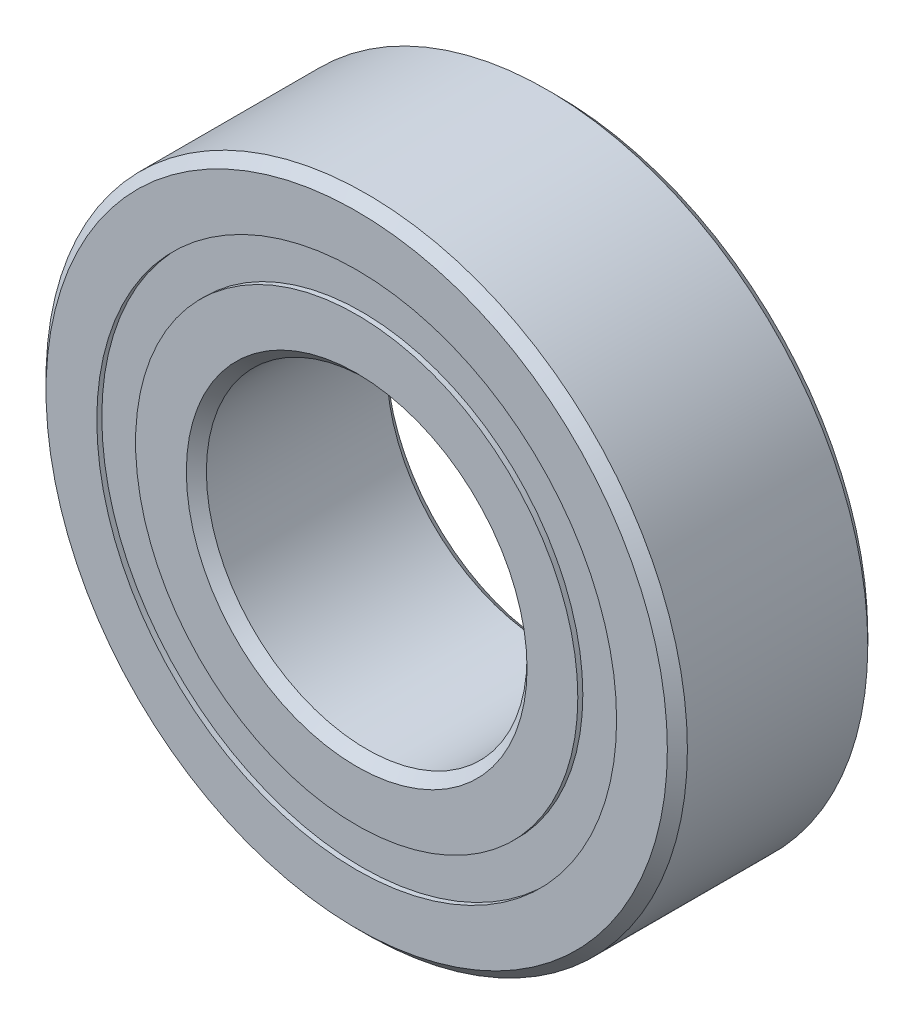
ISO-10303-21;
HEADER;
FILE_DESCRIPTION(('STEP AP214'),'2;1');
FILE_NAME('part.step','',(''),(''),'','','');
FILE_SCHEMA(('AUTOMOTIVE_DESIGN { 1 0 10303 214 1 1 1 1 }'));
ENDSEC;
DATA;
#1=APPLICATION_CONTEXT('core data for automotive mechanical design processes');
#2=APPLICATION_PROTOCOL_DEFINITION('international standard','automotive_design',2000,#1);
#3=PRODUCT_CONTEXT('',#1,'mechanical');
#4=PRODUCT('Part','Part','',(#3));
#5=PRODUCT_RELATED_PRODUCT_CATEGORY('part','',(#4));
#6=PRODUCT_DEFINITION_FORMATION('','',#4);
#7=PRODUCT_DEFINITION_CONTEXT('part definition',#1,'design');
#8=PRODUCT_DEFINITION('design','',#6,#7);
#9=PRODUCT_DEFINITION_SHAPE('','',#8);
#10=(LENGTH_UNIT() NAMED_UNIT(*) SI_UNIT(.MILLI.,.METRE.));
#11=(NAMED_UNIT(*) PLANE_ANGLE_UNIT() SI_UNIT($,.RADIAN.));
#12=(NAMED_UNIT(*) SI_UNIT($,.STERADIAN.) SOLID_ANGLE_UNIT());
#13=UNCERTAINTY_MEASURE_WITH_UNIT(LENGTH_MEASURE(1.E-05),#10,'distance_accuracy_value','');
#14=(GEOMETRIC_REPRESENTATION_CONTEXT(3) GLOBAL_UNCERTAINTY_ASSIGNED_CONTEXT((#13)) GLOBAL_UNIT_ASSIGNED_CONTEXT((#10,
#11,#12)) REPRESENTATION_CONTEXT('',''));
#15=CARTESIAN_POINT('',(0.,0.,0.));
#16=DIRECTION('',(0.,0.,1.));
#17=DIRECTION('',(1.,0.,0.));
#18=AXIS2_PLACEMENT_3D('',#15,#16,#17);
#19=CARTESIAN_POINT('',(0.,6.48351648351648,-2.375));
#20=DIRECTION('',(0.,0.,1.));
#21=DIRECTION('',(1.,0.,0.));
#22=AXIS2_PLACEMENT_3D('',#19,#20,#21);
#23=PLANE('',#22);
#24=CARTESIAN_POINT('',(0.,0.,-2.375));
#25=DIRECTION('',(0.,0.,1.));
#26=DIRECTION('',(1.,0.,0.));
#27=AXIS2_PLACEMENT_3D('',#24,#25,#26);
#28=CIRCLE('',#27,6.48351648351648);
#29=CARTESIAN_POINT('',(6.48351648351648,0.,-2.375));
#30=VERTEX_POINT('',#29);
#31=EDGE_CURVE('E57',#30,#30,#28,.T.);
#32=ORIENTED_EDGE('',*,*,#31,.F.);
#33=EDGE_LOOP('',(#32));
#34=FACE_BOUND('',#33,.T.);
#35=CARTESIAN_POINT('',(0.,0.,-2.375));
#36=DIRECTION('',(0.,0.,1.));
#37=DIRECTION('',(1.,0.,0.));
#38=AXIS2_PLACEMENT_3D('',#35,#36,#37);
#39=CIRCLE('',#38,5.51648351648352);
#40=CARTESIAN_POINT('',(5.51648351648352,0.,-2.375));
#41=VERTEX_POINT('',#40);
#42=EDGE_CURVE('E11',#41,#41,#39,.T.);
#43=ORIENTED_EDGE('',*,*,#42,.T.);
#44=EDGE_LOOP('',(#43));
#45=FACE_BOUND('',#44,.T.);
#46=ADVANCED_FACE('F43',(#34,#45),#23,.F.);
#47=CARTESIAN_POINT('',(0.,0.,2.5));
#48=DIRECTION('',(0.,0.,1.));
#49=DIRECTION('',(1.,0.,0.));
#50=AXIS2_PLACEMENT_3D('',#47,#48,#49);
#51=CYLINDRICAL_SURFACE('',#50,5.51648351648352);
#52=ORIENTED_EDGE('',*,*,#42,.F.);
#53=EDGE_LOOP('',(#52));
#54=FACE_BOUND('',#53,.T.);
#55=CARTESIAN_POINT('',(0.,0.,-1.21175743903915));
#56=DIRECTION('',(0.,0.,1.));
#57=DIRECTION('',(1.,0.,0.));
#58=AXIS2_PLACEMENT_3D('',#55,#56,#57);
#59=CIRCLE('',#58,5.51648351648352);
#60=CARTESIAN_POINT('',(5.51648351648352,0.,-1.21175743903915));
#61=VERTEX_POINT('',#60);
#62=EDGE_CURVE('E49',#61,#61,#59,.T.);
#63=ORIENTED_EDGE('',*,*,#62,.T.);
#64=EDGE_LOOP('',(#63));
#65=FACE_BOUND('',#64,.T.);
#66=ADVANCED_FACE('F66',(#54,#65),#51,.F.);
#67=CARTESIAN_POINT('',(0.,6.48351648351648,-1.21175743903915));
#68=DIRECTION('',(0.,0.,-1.));
#69=DIRECTION('',(-1.,0.,0.));
#70=AXIS2_PLACEMENT_3D('',#67,#68,#69);
#71=PLANE('',#70);
#72=ORIENTED_EDGE('',*,*,#62,.F.);
#73=EDGE_LOOP('',(#72));
#74=FACE_BOUND('',#73,.T.);
#75=CARTESIAN_POINT('',(0.,0.,-1.21175743903915));
#76=DIRECTION('',(0.,0.,1.));
#77=DIRECTION('',(1.,0.,0.));
#78=AXIS2_PLACEMENT_3D('',#75,#76,#77);
#79=CIRCLE('',#78,6.48351648351648);
#80=CARTESIAN_POINT('',(6.48351648351648,0.,-1.21175743903915));
#81=VERTEX_POINT('',#80);
#82=EDGE_CURVE('E53',#81,#81,#79,.T.);
#83=ORIENTED_EDGE('',*,*,#82,.T.);
#84=EDGE_LOOP('',(#83));
#85=FACE_BOUND('',#84,.T.);
#86=ADVANCED_FACE('F70',(#74,#85),#71,.F.);
#87=CARTESIAN_POINT('',(0.,0.,2.5));
#88=DIRECTION('',(0.,0.,1.));
#89=DIRECTION('',(1.,0.,0.));
#90=AXIS2_PLACEMENT_3D('',#87,#88,#89);
#91=CYLINDRICAL_SURFACE('',#90,6.48351648351648);
#92=ORIENTED_EDGE('',*,*,#82,.F.);
#93=EDGE_LOOP('',(#92));
#94=FACE_BOUND('',#93,.T.);
#95=ORIENTED_EDGE('',*,*,#31,.T.);
#96=EDGE_LOOP('',(#95));
#97=FACE_BOUND('',#96,.T.);
#98=ADVANCED_FACE('F63',(#94,#97),#91,.T.);
#99=CLOSED_SHELL('',(#46,#66,#86,#98));
#100=MANIFOLD_SOLID_BREP('B2',#99);
#101=CARTESIAN_POINT('',(0.,6.48351648351648,2.375));
#102=DIRECTION('',(0.,0.,-1.));
#103=DIRECTION('',(-1.,0.,0.));
#104=AXIS2_PLACEMENT_3D('',#101,#102,#103);
#105=PLANE('',#104);
#106=CARTESIAN_POINT('',(0.,0.,2.375));
#107=DIRECTION('',(0.,0.,1.));
#108=DIRECTION('',(1.,0.,0.));
#109=AXIS2_PLACEMENT_3D('',#106,#107,#108);
#110=CIRCLE('',#109,5.51648351648352);
#111=CARTESIAN_POINT('',(5.51648351648352,0.,2.375));
#112=VERTEX_POINT('',#111);
#113=EDGE_CURVE('E42',#112,#112,#110,.T.);
#114=ORIENTED_EDGE('',*,*,#113,.F.);
#115=EDGE_LOOP('',(#114));
#116=FACE_BOUND('',#115,.T.);
#117=CARTESIAN_POINT('',(0.,0.,2.375));
#118=DIRECTION('',(0.,0.,1.));
#119=DIRECTION('',(1.,0.,0.));
#120=AXIS2_PLACEMENT_3D('',#117,#118,#119);
#121=CIRCLE('',#120,6.48351648351648);
#122=CARTESIAN_POINT('',(6.48351648351648,0.,2.375));
#123=VERTEX_POINT('',#122);
#124=EDGE_CURVE('E124',#123,#123,#121,.T.);
#125=ORIENTED_EDGE('',*,*,#124,.T.);
#126=EDGE_LOOP('',(#125));
#127=FACE_BOUND('',#126,.T.);
#128=ADVANCED_FACE('F110',(#116,#127),#105,.F.);
#129=CARTESIAN_POINT('',(0.,0.,2.5));
#130=DIRECTION('',(0.,0.,1.));
#131=DIRECTION('',(1.,0.,0.));
#132=AXIS2_PLACEMENT_3D('',#129,#130,#131);
#133=CYLINDRICAL_SURFACE('',#132,5.51648351648352);
#134=CARTESIAN_POINT('',(0.,0.,1.21175743903915));
#135=DIRECTION('',(0.,0.,1.));
#136=DIRECTION('',(1.,0.,0.));
#137=AXIS2_PLACEMENT_3D('',#134,#135,#136);
#138=CIRCLE('',#137,5.51648351648352);
#139=CARTESIAN_POINT('',(5.51648351648352,0.,1.21175743903915));
#140=VERTEX_POINT('',#139);
#141=EDGE_CURVE('E116',#140,#140,#138,.T.);
#142=ORIENTED_EDGE('',*,*,#141,.F.);
#143=EDGE_LOOP('',(#142));
#144=FACE_BOUND('',#143,.T.);
#145=ORIENTED_EDGE('',*,*,#113,.T.);
#146=EDGE_LOOP('',(#145));
#147=FACE_BOUND('',#146,.T.);
#148=ADVANCED_FACE('F139',(#144,#147),#133,.F.);
#149=CARTESIAN_POINT('',(0.,6.48351648351648,1.21175743903915));
#150=DIRECTION('',(0.,0.,1.));
#151=DIRECTION('',(1.,0.,0.));
#152=AXIS2_PLACEMENT_3D('',#149,#150,#151);
#153=PLANE('',#152);
#154=CARTESIAN_POINT('',(0.,0.,1.21175743903915));
#155=DIRECTION('',(0.,0.,1.));
#156=DIRECTION('',(1.,0.,0.));
#157=AXIS2_PLACEMENT_3D('',#154,#155,#156);
#158=CIRCLE('',#157,6.48351648351648);
#159=CARTESIAN_POINT('',(6.48351648351648,0.,1.21175743903915));
#160=VERTEX_POINT('',#159);
#161=EDGE_CURVE('E120',#160,#160,#158,.T.);
#162=ORIENTED_EDGE('',*,*,#161,.F.);
#163=EDGE_LOOP('',(#162));
#164=FACE_BOUND('',#163,.T.);
#165=ORIENTED_EDGE('',*,*,#141,.T.);
#166=EDGE_LOOP('',(#165));
#167=FACE_BOUND('',#166,.T.);
#168=ADVANCED_FACE('F134',(#164,#167),#153,.F.);
#169=CARTESIAN_POINT('',(0.,0.,2.5));
#170=DIRECTION('',(0.,0.,1.));
#171=DIRECTION('',(1.,0.,0.));
#172=AXIS2_PLACEMENT_3D('',#169,#170,#171);
#173=CYLINDRICAL_SURFACE('',#172,6.48351648351648);
#174=ORIENTED_EDGE('',*,*,#124,.F.);
#175=EDGE_LOOP('',(#174));
#176=FACE_BOUND('',#175,.T.);
#177=ORIENTED_EDGE('',*,*,#161,.T.);
#178=EDGE_LOOP('',(#177));
#179=FACE_BOUND('',#178,.T.);
#180=ADVANCED_FACE('F131',(#176,#179),#173,.T.);
#181=CLOSED_SHELL('',(#128,#148,#168,#180));
#182=MANIFOLD_SOLID_BREP('B6',#181);
#183=CARTESIAN_POINT('',(-2.99999999999993,5.19615242270667,0.));
#184=DIRECTION('',(0.,0.,1.));
#185=DIRECTION('',(-0.499999999999989,0.866025403784445,0.));
#186=AXIS2_PLACEMENT_3D('',#183,#184,#185);
#187=SPHERICAL_SURFACE('',#186,1.21175743903915);
#188=CARTESIAN_POINT('',(-2.99999999999993,5.19615242270667,1.21175743903915));
#189=VERTEX_POINT('',#188);
#190=VERTEX_LOOP('',#189);
#191=FACE_BOUND('',#190,.T.);
#192=ADVANCED_FACE('F177',(#191),#187,.T.);
#193=CLOSED_SHELL('',(#192));
#194=MANIFOLD_SOLID_BREP('B37',#193);
#195=CARTESIAN_POINT('',(-5.1961524227066,3.00000000000006,0.));
#196=DIRECTION('',(0.,0.,1.));
#197=DIRECTION('',(-0.866025403784433,0.50000000000001,0.));
#198=AXIS2_PLACEMENT_3D('',#195,#196,#197);
#199=SPHERICAL_SURFACE('',#198,1.21175743903915);
#200=CARTESIAN_POINT('',(-5.1961524227066,3.00000000000006,1.21175743903915));
#201=VERTEX_POINT('',#200);
#202=VERTEX_LOOP('',#201);
#203=FACE_BOUND('',#202,.T.);
#204=ADVANCED_FACE('F197',(#203),#199,.T.);
#205=CLOSED_SHELL('',(#204));
#206=MANIFOLD_SOLID_BREP('B106',#205);
#207=CARTESIAN_POINT('',(-6.,0.,0.));
#208=DIRECTION('',(0.,0.,1.));
#209=DIRECTION('',(-1.,0.,0.));
#210=AXIS2_PLACEMENT_3D('',#207,#208,#209);
#211=SPHERICAL_SURFACE('',#210,1.21175743903915);
#212=CARTESIAN_POINT('',(-6.,0.,1.21175743903915));
#213=VERTEX_POINT('',#212);
#214=VERTEX_LOOP('',#213);
#215=FACE_BOUND('',#214,.T.);
#216=ADVANCED_FACE('F217',(#215),#211,.T.);
#217=CLOSED_SHELL('',(#216));
#218=MANIFOLD_SOLID_BREP('B173',#217);
#219=CARTESIAN_POINT('',(-5.19615242270666,-2.99999999999995,0.));
#220=DIRECTION('',(0.,0.,1.));
#221=DIRECTION('',(-0.866025403784443,-0.499999999999992,0.));
#222=AXIS2_PLACEMENT_3D('',#219,#220,#221);
#223=SPHERICAL_SURFACE('',#222,1.21175743903915);
#224=CARTESIAN_POINT('',(-5.19615242270666,-2.99999999999995,1.21175743903915));
#225=VERTEX_POINT('',#224);
#226=VERTEX_LOOP('',#225);
#227=FACE_BOUND('',#226,.T.);
#228=ADVANCED_FACE('F237',(#227),#223,.T.);
#229=CLOSED_SHELL('',(#228));
#230=MANIFOLD_SOLID_BREP('B193',#229);
#231=CARTESIAN_POINT('',(-3.00000000000004,-5.19615242270661,0.));
#232=DIRECTION('',(0.,0.,1.));
#233=DIRECTION('',(-0.500000000000007,-0.866025403784435,0.));
#234=AXIS2_PLACEMENT_3D('',#231,#232,#233);
#235=SPHERICAL_SURFACE('',#234,1.21175743903915);
#236=CARTESIAN_POINT('',(-3.00000000000004,-5.19615242270661,1.21175743903915));
#237=VERTEX_POINT('',#236);
#238=VERTEX_LOOP('',#237);
#239=FACE_BOUND('',#238,.T.);
#240=ADVANCED_FACE('F257',(#239),#235,.T.);
#241=CLOSED_SHELL('',(#240));
#242=MANIFOLD_SOLID_BREP('B213',#241);
#243=CARTESIAN_POINT('',(0.,-6.,0.));
#244=DIRECTION('',(0.,0.,1.));
#245=DIRECTION('',(0.,-1.,0.));
#246=AXIS2_PLACEMENT_3D('',#243,#244,#245);
#247=SPHERICAL_SURFACE('',#246,1.21175743903915);
#248=CARTESIAN_POINT('',(0.,-6.,1.21175743903915));
#249=VERTEX_POINT('',#248);
#250=VERTEX_LOOP('',#249);
#251=FACE_BOUND('',#250,.T.);
#252=ADVANCED_FACE('F277',(#251),#247,.T.);
#253=CLOSED_SHELL('',(#252));
#254=MANIFOLD_SOLID_BREP('B233',#253);
#255=CARTESIAN_POINT('',(2.99999999999997,-5.19615242270665,0.));
#256=DIRECTION('',(0.,0.,1.));
#257=DIRECTION('',(0.499999999999995,-0.866025403784442,0.));
#258=AXIS2_PLACEMENT_3D('',#255,#256,#257);
#259=SPHERICAL_SURFACE('',#258,1.21175743903915);
#260=CARTESIAN_POINT('',(2.99999999999997,-5.19615242270665,1.21175743903915));
#261=VERTEX_POINT('',#260);
#262=VERTEX_LOOP('',#261);
#263=FACE_BOUND('',#262,.T.);
#264=ADVANCED_FACE('F297',(#263),#259,.T.);
#265=CLOSED_SHELL('',(#264));
#266=MANIFOLD_SOLID_BREP('B253',#265);
#267=CARTESIAN_POINT('',(5.19615242270662,-3.00000000000002,0.));
#268=DIRECTION('',(0.,0.,1.));
#269=DIRECTION('',(0.866025403784436,-0.500000000000004,0.));
#270=AXIS2_PLACEMENT_3D('',#267,#268,#269);
#271=SPHERICAL_SURFACE('',#270,1.21175743903915);
#272=CARTESIAN_POINT('',(5.19615242270662,-3.00000000000002,1.21175743903915));
#273=VERTEX_POINT('',#272);
#274=VERTEX_LOOP('',#273);
#275=FACE_BOUND('',#274,.T.);
#276=ADVANCED_FACE('F317',(#275),#271,.T.);
#277=CLOSED_SHELL('',(#276));
#278=MANIFOLD_SOLID_BREP('B273',#277);
#279=CARTESIAN_POINT('',(6.,0.,0.));
#280=DIRECTION('',(0.,0.,1.));
#281=DIRECTION('',(1.,0.,0.));
#282=AXIS2_PLACEMENT_3D('',#279,#280,#281);
#283=SPHERICAL_SURFACE('',#282,1.21175743903915);
#284=CARTESIAN_POINT('',(6.,0.,1.21175743903915));
#285=VERTEX_POINT('',#284);
#286=VERTEX_LOOP('',#285);
#287=FACE_BOUND('',#286,.T.);
#288=ADVANCED_FACE('F337',(#287),#283,.T.);
#289=CLOSED_SHELL('',(#288));
#290=MANIFOLD_SOLID_BREP('B293',#289);
#291=CARTESIAN_POINT('',(5.19615242270664,2.99999999999999,0.));
#292=DIRECTION('',(0.,0.,1.));
#293=DIRECTION('',(0.86602540378444,0.499999999999998,0.));
#294=AXIS2_PLACEMENT_3D('',#291,#292,#293);
#295=SPHERICAL_SURFACE('',#294,1.21175743903915);
#296=CARTESIAN_POINT('',(5.19615242270664,2.99999999999999,1.21175743903915));
#297=VERTEX_POINT('',#296);
#298=VERTEX_LOOP('',#297);
#299=FACE_BOUND('',#298,.T.);
#300=ADVANCED_FACE('F357',(#299),#295,.T.);
#301=CLOSED_SHELL('',(#300));
#302=MANIFOLD_SOLID_BREP('B313',#301);
#303=CARTESIAN_POINT('',(3.00000000000001,5.19615242270663,0.));
#304=DIRECTION('',(0.,0.,1.));
#305=DIRECTION('',(0.500000000000001,0.866025403784438,0.));
#306=AXIS2_PLACEMENT_3D('',#303,#304,#305);
#307=SPHERICAL_SURFACE('',#306,1.21175743903915);
#308=CARTESIAN_POINT('',(3.00000000000001,5.19615242270663,1.21175743903915));
#309=VERTEX_POINT('',#308);
#310=VERTEX_LOOP('',#309);
#311=FACE_BOUND('',#310,.T.);
#312=ADVANCED_FACE('F377',(#311),#307,.T.);
#313=CLOSED_SHELL('',(#312));
#314=MANIFOLD_SOLID_BREP('B333',#313);
#315=CARTESIAN_POINT('',(0.,6.,0.));
#316=DIRECTION('',(0.,0.,1.));
#317=DIRECTION('',(0.,1.,0.));
#318=AXIS2_PLACEMENT_3D('',#315,#316,#317);
#319=SPHERICAL_SURFACE('',#318,1.21175743903915);
#320=CARTESIAN_POINT('',(0.,6.,1.21175743903915));
#321=VERTEX_POINT('',#320);
#322=VERTEX_LOOP('',#321);
#323=FACE_BOUND('',#322,.T.);
#324=ADVANCED_FACE('F399',(#323),#319,.T.);
#325=CLOSED_SHELL('',(#324));
#326=MANIFOLD_SOLID_BREP('B353',#325);
#327=CARTESIAN_POINT('',(0.,5.51648351648352,2.5));
#328=DIRECTION('',(0.,0.,-1.));
#329=DIRECTION('',(-1.,0.,0.));
#330=AXIS2_PLACEMENT_3D('',#327,#328,#329);
#331=PLANE('',#330);
#332=CARTESIAN_POINT('',(0.,0.,2.5));
#333=DIRECTION('',(0.,0.,1.));
#334=DIRECTION('',(1.,0.,0.));
#335=AXIS2_PLACEMENT_3D('',#332,#333,#334);
#336=CIRCLE('',#335,4.25);
#337=CARTESIAN_POINT('',(4.25,0.,2.5));
#338=VERTEX_POINT('',#337);
#339=EDGE_CURVE('E446',#338,#338,#336,.T.);
#340=ORIENTED_EDGE('',*,*,#339,.F.);
#341=EDGE_LOOP('',(#340));
#342=FACE_BOUND('',#341,.T.);
#343=CARTESIAN_POINT('',(0.,0.,2.5));
#344=DIRECTION('',(0.,0.,1.));
#345=DIRECTION('',(1.,0.,0.));
#346=AXIS2_PLACEMENT_3D('',#343,#344,#345);
#347=CIRCLE('',#346,5.51648351648352);
#348=CARTESIAN_POINT('',(5.51648351648352,0.,2.5));
#349=VERTEX_POINT('',#348);
#350=EDGE_CURVE('E398',#349,#349,#347,.T.);
#351=ORIENTED_EDGE('',*,*,#350,.T.);
#352=EDGE_LOOP('',(#351));
#353=FACE_BOUND('',#352,.T.);
#354=ADVANCED_FACE('F418',(#342,#353),#331,.F.);
#355=CARTESIAN_POINT('',(0.,0.,2.5));
#356=DIRECTION('',(0.,0.,1.));
#357=DIRECTION('',(1.,0.,0.));
#358=AXIS2_PLACEMENT_3D('',#355,#356,#357);
#359=CYLINDRICAL_SURFACE('',#358,5.51648351648352);
#360=ORIENTED_EDGE('',*,*,#350,.F.);
#361=EDGE_LOOP('',(#360));
#362=FACE_BOUND('',#361,.T.);
#363=CARTESIAN_POINT('',(0.,0.,1.11111111111111));
#364=DIRECTION('',(0.,0.,1.));
#365=DIRECTION('',(1.,0.,0.));
#366=AXIS2_PLACEMENT_3D('',#363,#364,#365);
#367=CIRCLE('',#366,5.51648351648352);
#368=CARTESIAN_POINT('',(5.51648351648352,0.,1.11111111111111));
#369=VERTEX_POINT('',#368);
#370=EDGE_CURVE('E424',#369,#369,#367,.T.);
#371=ORIENTED_EDGE('',*,*,#370,.T.);
#372=EDGE_LOOP('',(#371));
#373=FACE_BOUND('',#372,.T.);
#374=ADVANCED_FACE('F453',(#362,#373),#359,.T.);
#375=CARTESIAN_POINT('',(0.,0.,0.));
#376=DIRECTION('',(0.,0.,1.));
#377=DIRECTION('',(1.,0.,0.));
#378=AXIS2_PLACEMENT_3D('',#375,#376,#377);
#379=TOROIDAL_SURFACE('',#378,6.,1.21175743903915);
#380=ORIENTED_EDGE('',*,*,#370,.F.);
#381=EDGE_LOOP('',(#380));
#382=FACE_BOUND('',#381,.T.);
#383=CARTESIAN_POINT('',(0.,0.,-1.11111111111111));
#384=DIRECTION('',(0.,0.,1.));
#385=DIRECTION('',(1.,0.,0.));
#386=AXIS2_PLACEMENT_3D('',#383,#384,#385);
#387=CIRCLE('',#386,5.51648351648352);
#388=CARTESIAN_POINT('',(5.51648351648352,0.,-1.11111111111111));
#389=VERTEX_POINT('',#388);
#390=EDGE_CURVE('E428',#389,#389,#387,.T.);
#391=ORIENTED_EDGE('',*,*,#390,.T.);
#392=EDGE_LOOP('',(#391));
#393=FACE_BOUND('',#392,.T.);
#394=ADVANCED_FACE('F457',(#382,#393),#379,.F.);
#395=CARTESIAN_POINT('',(0.,0.,2.5));
#396=DIRECTION('',(0.,0.,1.));
#397=DIRECTION('',(1.,0.,0.));
#398=AXIS2_PLACEMENT_3D('',#395,#396,#397);
#399=CYLINDRICAL_SURFACE('',#398,5.51648351648352);
#400=ORIENTED_EDGE('',*,*,#390,.F.);
#401=EDGE_LOOP('',(#400));
#402=FACE_BOUND('',#401,.T.);
#403=CARTESIAN_POINT('',(0.,0.,-2.5));
#404=DIRECTION('',(0.,0.,1.));
#405=DIRECTION('',(1.,0.,0.));
#406=AXIS2_PLACEMENT_3D('',#403,#404,#405);
#407=CIRCLE('',#406,5.51648351648352);
#408=CARTESIAN_POINT('',(5.51648351648352,0.,-2.5));
#409=VERTEX_POINT('',#408);
#410=EDGE_CURVE('E432',#409,#409,#407,.T.);
#411=ORIENTED_EDGE('',*,*,#410,.T.);
#412=EDGE_LOOP('',(#411));
#413=FACE_BOUND('',#412,.T.);
#414=ADVANCED_FACE('F462',(#402,#413),#399,.T.);
#415=CARTESIAN_POINT('',(0.,4.25,-2.5));
#416=DIRECTION('',(0.,0.,1.));
#417=DIRECTION('',(1.,0.,0.));
#418=AXIS2_PLACEMENT_3D('',#415,#416,#417);
#419=PLANE('',#418);
#420=ORIENTED_EDGE('',*,*,#410,.F.);
#421=EDGE_LOOP('',(#420));
#422=FACE_BOUND('',#421,.T.);
#423=CARTESIAN_POINT('',(0.,0.,-2.5));
#424=DIRECTION('',(0.,0.,1.));
#425=DIRECTION('',(1.,0.,0.));
#426=AXIS2_PLACEMENT_3D('',#423,#424,#425);
#427=CIRCLE('',#426,4.25);
#428=CARTESIAN_POINT('',(4.25,0.,-2.5));
#429=VERTEX_POINT('',#428);
#430=EDGE_CURVE('E437',#429,#429,#427,.T.);
#431=ORIENTED_EDGE('',*,*,#430,.T.);
#432=EDGE_LOOP('',(#431));
#433=FACE_BOUND('',#432,.T.);
#434=ADVANCED_FACE('F468',(#422,#433),#419,.F.);
#435=CARTESIAN_POINT('',(0.,0.,-2.25));
#436=DIRECTION('',(0.,0.,-1.));
#437=DIRECTION('',(-1.,0.,0.));
#438=AXIS2_PLACEMENT_3D('',#435,#436,#437);
#439=CONICAL_SURFACE('',#438,4.,0.785398163397447);
#440=ORIENTED_EDGE('',*,*,#430,.F.);
#441=EDGE_LOOP('',(#440));
#442=FACE_BOUND('',#441,.T.);
#443=CARTESIAN_POINT('',(0.,0.,-2.25));
#444=DIRECTION('',(0.,0.,1.));
#445=DIRECTION('',(1.,0.,0.));
#446=AXIS2_PLACEMENT_3D('',#443,#444,#445);
#447=CIRCLE('',#446,4.);
#448=CARTESIAN_POINT('',(4.,0.,-2.25));
#449=VERTEX_POINT('',#448);
#450=EDGE_CURVE('E440',#449,#449,#447,.T.);
#451=ORIENTED_EDGE('',*,*,#450,.T.);
#452=EDGE_LOOP('',(#451));
#453=FACE_BOUND('',#452,.T.);
#454=ADVANCED_FACE('F472',(#442,#453),#439,.F.);
#455=CARTESIAN_POINT('',(0.,0.,2.5));
#456=DIRECTION('',(0.,0.,1.));
#457=DIRECTION('',(1.,0.,0.));
#458=AXIS2_PLACEMENT_3D('',#455,#456,#457);
#459=CYLINDRICAL_SURFACE('',#458,4.);
#460=ORIENTED_EDGE('',*,*,#450,.F.);
#461=EDGE_LOOP('',(#460));
#462=FACE_BOUND('',#461,.T.);
#463=CARTESIAN_POINT('',(0.,0.,2.25));
#464=DIRECTION('',(0.,0.,1.));
#465=DIRECTION('',(1.,0.,0.));
#466=AXIS2_PLACEMENT_3D('',#463,#464,#465);
#467=CIRCLE('',#466,4.);
#468=CARTESIAN_POINT('',(4.,0.,2.25));
#469=VERTEX_POINT('',#468);
#470=EDGE_CURVE('E443',#469,#469,#467,.T.);
#471=ORIENTED_EDGE('',*,*,#470,.T.);
#472=EDGE_LOOP('',(#471));
#473=FACE_BOUND('',#472,.T.);
#474=ADVANCED_FACE('F476',(#462,#473),#459,.F.);
#475=CARTESIAN_POINT('',(0.,0.,2.5));
#476=DIRECTION('',(0.,0.,1.));
#477=DIRECTION('',(1.,0.,0.));
#478=AXIS2_PLACEMENT_3D('',#475,#476,#477);
#479=CONICAL_SURFACE('',#478,4.25,0.785398163397452);
#480=ORIENTED_EDGE('',*,*,#470,.F.);
#481=EDGE_LOOP('',(#480));
#482=FACE_BOUND('',#481,.T.);
#483=ORIENTED_EDGE('',*,*,#339,.T.);
#484=EDGE_LOOP('',(#483));
#485=FACE_BOUND('',#484,.T.);
#486=ADVANCED_FACE('F450',(#482,#485),#479,.F.);
#487=CLOSED_SHELL('',(#354,#374,#394,#414,#434,#454,#474,#486));
#488=MANIFOLD_SOLID_BREP('B373',#487);
#489=CARTESIAN_POINT('',(0.,0.,2.25));
#490=DIRECTION('',(0.,0.,-1.));
#491=DIRECTION('',(-1.,0.,0.));
#492=AXIS2_PLACEMENT_3D('',#489,#490,#491);
#493=CONICAL_SURFACE('',#492,8.,0.785398163397448);
#494=CARTESIAN_POINT('',(0.,0.,2.5));
#495=DIRECTION('',(0.,0.,1.));
#496=DIRECTION('',(1.,0.,0.));
#497=AXIS2_PLACEMENT_3D('',#494,#495,#496);
#498=CIRCLE('',#497,7.75);
#499=CARTESIAN_POINT('',(7.75,0.,2.5));
#500=VERTEX_POINT('',#499);
#501=EDGE_CURVE('E567',#500,#500,#498,.T.);
#502=ORIENTED_EDGE('',*,*,#501,.F.);
#503=EDGE_LOOP('',(#502));
#504=FACE_BOUND('',#503,.T.);
#505=CARTESIAN_POINT('',(0.,0.,2.25));
#506=DIRECTION('',(0.,0.,1.));
#507=DIRECTION('',(1.,0.,0.));
#508=AXIS2_PLACEMENT_3D('',#505,#506,#507);
#509=CIRCLE('',#508,8.);
#510=CARTESIAN_POINT('',(8.,0.,2.25));
#511=VERTEX_POINT('',#510);
#512=EDGE_CURVE('E417',#511,#511,#509,.T.);
#513=ORIENTED_EDGE('',*,*,#512,.T.);
#514=EDGE_LOOP('',(#513));
#515=FACE_BOUND('',#514,.T.);
#516=ADVANCED_FACE('F539',(#504,#515),#493,.T.);
#517=CARTESIAN_POINT('',(0.,0.,2.5));
#518=DIRECTION('',(0.,0.,1.));
#519=DIRECTION('',(1.,0.,0.));
#520=AXIS2_PLACEMENT_3D('',#517,#518,#519);
#521=CYLINDRICAL_SURFACE('',#520,8.);
#522=ORIENTED_EDGE('',*,*,#512,.F.);
#523=EDGE_LOOP('',(#522));
#524=FACE_BOUND('',#523,.T.);
#525=CARTESIAN_POINT('',(0.,0.,-2.25));
#526=DIRECTION('',(0.,0.,1.));
#527=DIRECTION('',(1.,0.,0.));
#528=AXIS2_PLACEMENT_3D('',#525,#526,#527);
#529=CIRCLE('',#528,8.);
#530=CARTESIAN_POINT('',(8.,0.,-2.25));
#531=VERTEX_POINT('',#530);
#532=EDGE_CURVE('E545',#531,#531,#529,.T.);
#533=ORIENTED_EDGE('',*,*,#532,.T.);
#534=EDGE_LOOP('',(#533));
#535=FACE_BOUND('',#534,.T.);
#536=ADVANCED_FACE('F574',(#524,#535),#521,.T.);
#537=CARTESIAN_POINT('',(0.,0.,-2.5));
#538=DIRECTION('',(0.,0.,1.));
#539=DIRECTION('',(1.,0.,0.));
#540=AXIS2_PLACEMENT_3D('',#537,#538,#539);
#541=CONICAL_SURFACE('',#540,7.75,0.785398163397447);
#542=ORIENTED_EDGE('',*,*,#532,.F.);
#543=EDGE_LOOP('',(#542));
#544=FACE_BOUND('',#543,.T.);
#545=CARTESIAN_POINT('',(0.,0.,-2.5));
#546=DIRECTION('',(0.,0.,1.));
#547=DIRECTION('',(1.,0.,0.));
#548=AXIS2_PLACEMENT_3D('',#545,#546,#547);
#549=CIRCLE('',#548,7.75);
#550=CARTESIAN_POINT('',(7.75,0.,-2.5));
#551=VERTEX_POINT('',#550);
#552=EDGE_CURVE('E549',#551,#551,#549,.T.);
#553=ORIENTED_EDGE('',*,*,#552,.T.);
#554=EDGE_LOOP('',(#553));
#555=FACE_BOUND('',#554,.T.);
#556=ADVANCED_FACE('F578',(#544,#555),#541,.T.);
#557=CARTESIAN_POINT('',(0.,7.75,-2.5));
#558=DIRECTION('',(0.,0.,1.));
#559=DIRECTION('',(1.,0.,0.));
#560=AXIS2_PLACEMENT_3D('',#557,#558,#559);
#561=PLANE('',#560);
#562=ORIENTED_EDGE('',*,*,#552,.F.);
#563=EDGE_LOOP('',(#562));
#564=FACE_BOUND('',#563,.T.);
#565=CARTESIAN_POINT('',(0.,0.,-2.5));
#566=DIRECTION('',(0.,0.,1.));
#567=DIRECTION('',(1.,0.,0.));
#568=AXIS2_PLACEMENT_3D('',#565,#566,#567);
#569=CIRCLE('',#568,6.48351648351648);
#570=CARTESIAN_POINT('',(6.48351648351648,0.,-2.5));
#571=VERTEX_POINT('',#570);
#572=EDGE_CURVE('E553',#571,#571,#569,.T.);
#573=ORIENTED_EDGE('',*,*,#572,.T.);
#574=EDGE_LOOP('',(#573));
#575=FACE_BOUND('',#574,.T.);
#576=ADVANCED_FACE('F583',(#564,#575),#561,.F.);
#577=CARTESIAN_POINT('',(0.,0.,2.5));
#578=DIRECTION('',(0.,0.,1.));
#579=DIRECTION('',(1.,0.,0.));
#580=AXIS2_PLACEMENT_3D('',#577,#578,#579);
#581=CYLINDRICAL_SURFACE('',#580,6.48351648351648);
#582=ORIENTED_EDGE('',*,*,#572,.F.);
#583=EDGE_LOOP('',(#582));
#584=FACE_BOUND('',#583,.T.);
#585=CARTESIAN_POINT('',(0.,0.,-1.11111111111111));
#586=DIRECTION('',(0.,0.,1.));
#587=DIRECTION('',(1.,0.,0.));
#588=AXIS2_PLACEMENT_3D('',#585,#586,#587);
#589=CIRCLE('',#588,6.48351648351648);
#590=CARTESIAN_POINT('',(6.48351648351648,0.,-1.11111111111111));
#591=VERTEX_POINT('',#590);
#592=EDGE_CURVE('E558',#591,#591,#589,.T.);
#593=ORIENTED_EDGE('',*,*,#592,.T.);
#594=EDGE_LOOP('',(#593));
#595=FACE_BOUND('',#594,.T.);
#596=ADVANCED_FACE('F589',(#584,#595),#581,.F.);
#597=CARTESIAN_POINT('',(0.,0.,0.));
#598=DIRECTION('',(0.,0.,1.));
#599=DIRECTION('',(1.,0.,0.));
#600=AXIS2_PLACEMENT_3D('',#597,#598,#599);
#601=TOROIDAL_SURFACE('',#600,6.,1.21175743903915);
#602=ORIENTED_EDGE('',*,*,#592,.F.);
#603=EDGE_LOOP('',(#602));
#604=FACE_BOUND('',#603,.T.);
#605=CARTESIAN_POINT('',(0.,0.,1.11111111111111));
#606=DIRECTION('',(0.,0.,1.));
#607=DIRECTION('',(1.,0.,0.));
#608=AXIS2_PLACEMENT_3D('',#605,#606,#607);
#609=CIRCLE('',#608,6.48351648351648);
#610=CARTESIAN_POINT('',(6.48351648351648,0.,1.11111111111111));
#611=VERTEX_POINT('',#610);
#612=EDGE_CURVE('E561',#611,#611,#609,.T.);
#613=ORIENTED_EDGE('',*,*,#612,.T.);
#614=EDGE_LOOP('',(#613));
#615=FACE_BOUND('',#614,.T.);
#616=ADVANCED_FACE('F593',(#604,#615),#601,.F.);
#617=CARTESIAN_POINT('',(0.,0.,2.5));
#618=DIRECTION('',(0.,0.,1.));
#619=DIRECTION('',(1.,0.,0.));
#620=AXIS2_PLACEMENT_3D('',#617,#618,#619);
#621=CYLINDRICAL_SURFACE('',#620,6.48351648351648);
#622=ORIENTED_EDGE('',*,*,#612,.F.);
#623=EDGE_LOOP('',(#622));
#624=FACE_BOUND('',#623,.T.);
#625=CARTESIAN_POINT('',(0.,0.,2.5));
#626=DIRECTION('',(0.,0.,1.));
#627=DIRECTION('',(1.,0.,0.));
#628=AXIS2_PLACEMENT_3D('',#625,#626,#627);
#629=CIRCLE('',#628,6.48351648351648);
#630=CARTESIAN_POINT('',(6.48351648351648,0.,2.5));
#631=VERTEX_POINT('',#630);
#632=EDGE_CURVE('E564',#631,#631,#629,.T.);
#633=ORIENTED_EDGE('',*,*,#632,.T.);
#634=EDGE_LOOP('',(#633));
#635=FACE_BOUND('',#634,.T.);
#636=ADVANCED_FACE('F597',(#624,#635),#621,.F.);
#637=CARTESIAN_POINT('',(0.,7.75,2.5));
#638=DIRECTION('',(0.,0.,-1.));
#639=DIRECTION('',(-1.,0.,0.));
#640=AXIS2_PLACEMENT_3D('',#637,#638,#639);
#641=PLANE('',#640);
#642=ORIENTED_EDGE('',*,*,#632,.F.);
#643=EDGE_LOOP('',(#642));
#644=FACE_BOUND('',#643,.T.);
#645=ORIENTED_EDGE('',*,*,#501,.T.);
#646=EDGE_LOOP('',(#645));
#647=FACE_BOUND('',#646,.T.);
#648=ADVANCED_FACE('F571',(#644,#647),#641,.F.);
#649=CLOSED_SHELL('',(#516,#536,#556,#576,#596,#616,#636,#648));
#650=MANIFOLD_SOLID_BREP('B393',#649);
#651=ADVANCED_BREP_SHAPE_REPRESENTATION('',(#18,#100,#182,#194,#206,#218,#230,#242,#254,#266,
#278,#290,#302,#314,#326,#488,#650),#14);
#652=SHAPE_DEFINITION_REPRESENTATION(#9,#651);
ENDSEC;
END-ISO-10303-21;
